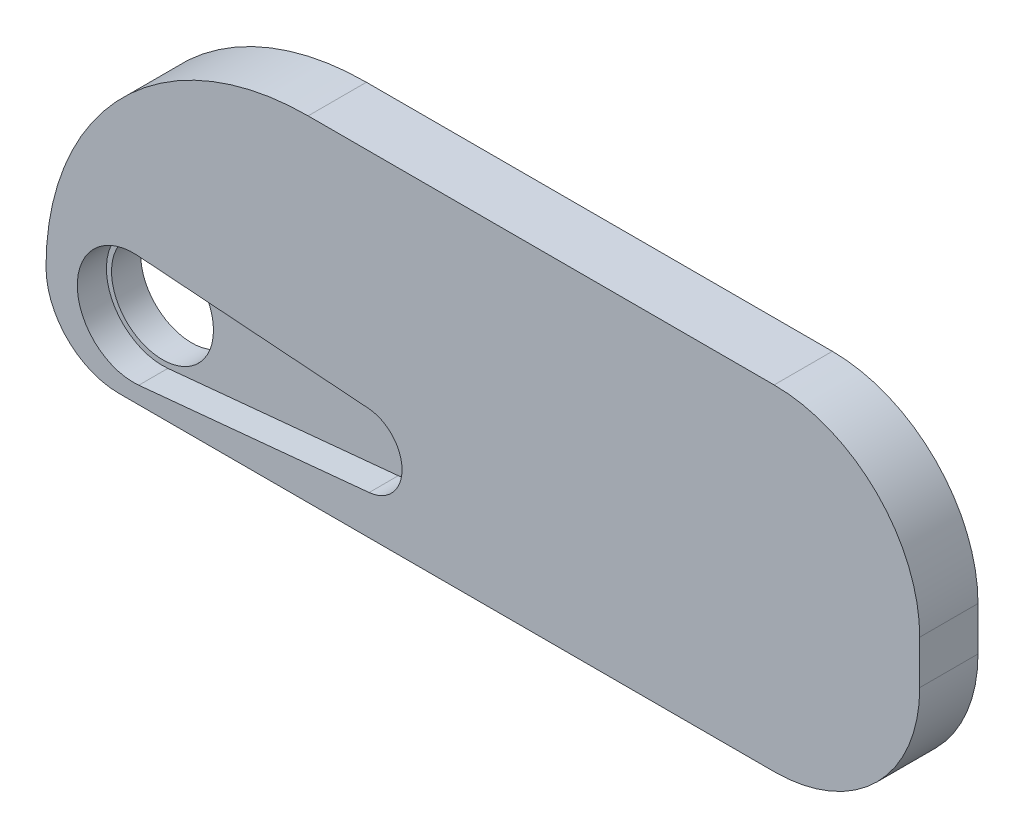
ISO-10303-21;
HEADER;
FILE_DESCRIPTION(('STEP AP214'),'2;1');
FILE_NAME('part.step','',(''),(''),'','','');
FILE_SCHEMA(('AUTOMOTIVE_DESIGN { 1 0 10303 214 1 1 1 1 }'));
ENDSEC;
DATA;
#1=APPLICATION_CONTEXT('core data for automotive mechanical design processes');
#2=APPLICATION_PROTOCOL_DEFINITION('international standard','automotive_design',2000,#1);
#3=PRODUCT_CONTEXT('',#1,'mechanical');
#4=PRODUCT('Part','Part','',(#3));
#5=PRODUCT_RELATED_PRODUCT_CATEGORY('part','',(#4));
#6=PRODUCT_DEFINITION_FORMATION('','',#4);
#7=PRODUCT_DEFINITION_CONTEXT('part definition',#1,'design');
#8=PRODUCT_DEFINITION('design','',#6,#7);
#9=PRODUCT_DEFINITION_SHAPE('','',#8);
#10=(LENGTH_UNIT() NAMED_UNIT(*) SI_UNIT(.MILLI.,.METRE.));
#11=(NAMED_UNIT(*) PLANE_ANGLE_UNIT() SI_UNIT($,.RADIAN.));
#12=(NAMED_UNIT(*) SI_UNIT($,.STERADIAN.) SOLID_ANGLE_UNIT());
#13=UNCERTAINTY_MEASURE_WITH_UNIT(LENGTH_MEASURE(1.E-05),#10,'distance_accuracy_value','');
#14=(GEOMETRIC_REPRESENTATION_CONTEXT(3) GLOBAL_UNCERTAINTY_ASSIGNED_CONTEXT((#13)) GLOBAL_UNIT_ASSIGNED_CONTEXT((#10,
#11,#12)) REPRESENTATION_CONTEXT('',''));
#15=CARTESIAN_POINT('',(0.,0.,0.));
#16=DIRECTION('',(0.,0.,1.));
#17=DIRECTION('',(1.,0.,0.));
#18=AXIS2_PLACEMENT_3D('',#15,#16,#17);
#19=CARTESIAN_POINT('',(0.,18.,4.));
#20=DIRECTION('',(0.,-1.,0.));
#21=DIRECTION('',(0.,0.,-1.));
#22=AXIS2_PLACEMENT_3D('',#19,#20,#21);
#23=PLANE('',#22);
#24=DIRECTION('',(0.,0.,1.));
#25=VECTOR('',#24,1.);
#26=CARTESIAN_POINT('',(18.,18.,0.));
#27=LINE('',#26,#25);
#28=CARTESIAN_POINT('',(18.,18.,0.));
#29=VERTEX_POINT('',#28);
#30=CARTESIAN_POINT('',(18.,18.,4.));
#31=VERTEX_POINT('',#30);
#32=EDGE_CURVE('E119',#29,#31,#27,.T.);
#33=ORIENTED_EDGE('',*,*,#32,.T.);
#34=DIRECTION('',(-1.,0.,0.));
#35=VECTOR('',#34,1.);
#36=CARTESIAN_POINT('',(0.,18.,4.));
#37=LINE('',#36,#35);
#38=CARTESIAN_POINT('',(50.,18.,4.));
#39=VERTEX_POINT('',#38);
#40=EDGE_CURVE('E151',#39,#31,#37,.T.);
#41=ORIENTED_EDGE('',*,*,#40,.F.);
#42=DIRECTION('',(0.,0.,-1.));
#43=VECTOR('',#42,1.);
#44=CARTESIAN_POINT('',(50.,18.,4.));
#45=LINE('',#44,#43);
#46=CARTESIAN_POINT('',(50.,18.,0.));
#47=VERTEX_POINT('',#46);
#48=EDGE_CURVE('E138',#39,#47,#45,.T.);
#49=ORIENTED_EDGE('',*,*,#48,.T.);
#50=DIRECTION('',(-1.,0.,0.));
#51=VECTOR('',#50,1.);
#52=CARTESIAN_POINT('',(0.,18.,0.));
#53=LINE('',#52,#51);
#54=EDGE_CURVE('E131',#47,#29,#53,.T.);
#55=ORIENTED_EDGE('',*,*,#54,.T.);
#56=EDGE_LOOP('',(#33,#41,#49,#55));
#57=FACE_BOUND('',#56,.T.);
#58=ADVANCED_FACE('F39',(#57),#23,.F.);
#59=CARTESIAN_POINT('',(6.,0.,0.));
#60=DIRECTION('',(0.,0.,1.));
#61=DIRECTION('',(1.,0.,0.));
#62=AXIS2_PLACEMENT_3D('',#59,#60,#61);
#63=CYLINDRICAL_SURFACE('',#62,3.5);
#64=CARTESIAN_POINT('',(6.,0.,0.));
#65=DIRECTION('',(0.,0.,1.));
#66=DIRECTION('',(1.,0.,0.));
#67=AXIS2_PLACEMENT_3D('',#64,#65,#66);
#68=CIRCLE('',#67,3.5);
#69=CARTESIAN_POINT('',(9.5,0.,0.));
#70=VERTEX_POINT('',#69);
#71=EDGE_CURVE('E172',#70,#70,#68,.T.);
#72=ORIENTED_EDGE('',*,*,#71,.F.);
#73=EDGE_LOOP('',(#72));
#74=FACE_BOUND('',#73,.T.);
#75=CARTESIAN_POINT('',(6.,0.,2.));
#76=DIRECTION('',(0.,0.,1.));
#77=DIRECTION('',(1.,0.,0.));
#78=AXIS2_PLACEMENT_3D('',#75,#76,#77);
#79=CIRCLE('',#78,3.5);
#80=CARTESIAN_POINT('',(9.5,0.,2.));
#81=VERTEX_POINT('',#80);
#82=EDGE_CURVE('E169',#81,#81,#79,.F.);
#83=ORIENTED_EDGE('',*,*,#82,.F.);
#84=EDGE_LOOP('',(#83));
#85=FACE_BOUND('',#84,.T.);
#86=ADVANCED_FACE('F253',(#74,#85),#63,.F.);
#87=CARTESIAN_POINT('',(0.,-5.,4.));
#88=DIRECTION('',(0.,1.,0.));
#89=DIRECTION('',(-1.,0.,0.));
#90=AXIS2_PLACEMENT_3D('',#87,#88,#89);
#91=PLANE('',#90);
#92=DIRECTION('',(1.,0.,0.));
#93=VECTOR('',#92,1.);
#94=CARTESIAN_POINT('',(0.,-5.,4.));
#95=LINE('',#94,#93);
#96=CARTESIAN_POINT('',(5.,-5.,4.));
#97=VERTEX_POINT('',#96);
#98=CARTESIAN_POINT('',(50.,-5.,4.));
#99=VERTEX_POINT('',#98);
#100=EDGE_CURVE('E139',#97,#99,#95,.T.);
#101=ORIENTED_EDGE('',*,*,#100,.F.);
#102=DIRECTION('',(0.,0.,-1.));
#103=VECTOR('',#102,1.);
#104=CARTESIAN_POINT('',(5.,-5.,4.));
#105=LINE('',#104,#103);
#106=CARTESIAN_POINT('',(5.,-5.,0.));
#107=VERTEX_POINT('',#106);
#108=EDGE_CURVE('E168',#97,#107,#105,.T.);
#109=ORIENTED_EDGE('',*,*,#108,.T.);
#110=DIRECTION('',(1.,0.,0.));
#111=VECTOR('',#110,1.);
#112=CARTESIAN_POINT('',(0.,-5.,0.));
#113=LINE('',#112,#111);
#114=CARTESIAN_POINT('',(50.,-5.,0.));
#115=VERTEX_POINT('',#114);
#116=EDGE_CURVE('E145',#107,#115,#113,.T.);
#117=ORIENTED_EDGE('',*,*,#116,.T.);
#118=DIRECTION('',(0.,0.,-1.));
#119=VECTOR('',#118,1.);
#120=CARTESIAN_POINT('',(50.,-5.,4.));
#121=LINE('',#120,#119);
#122=EDGE_CURVE('E165',#115,#99,#121,.F.);
#123=ORIENTED_EDGE('',*,*,#122,.T.);
#124=EDGE_LOOP('',(#101,#109,#117,#123));
#125=FACE_BOUND('',#124,.T.);
#126=ADVANCED_FACE('F182',(#125),#91,.F.);
#127=CARTESIAN_POINT('',(60.,18.,4.));
#128=DIRECTION('',(-1.,0.,0.));
#129=DIRECTION('',(0.,0.,1.));
#130=AXIS2_PLACEMENT_3D('',#127,#128,#129);
#131=PLANE('',#130);
#132=DIRECTION('',(0.,1.,0.));
#133=VECTOR('',#132,1.);
#134=CARTESIAN_POINT('',(60.,18.,0.));
#135=LINE('',#134,#133);
#136=CARTESIAN_POINT('',(60.,5.,0.));
#137=VERTEX_POINT('',#136);
#138=CARTESIAN_POINT('',(60.,8.,0.));
#139=VERTEX_POINT('',#138);
#140=EDGE_CURVE('E140',#137,#139,#135,.T.);
#141=ORIENTED_EDGE('',*,*,#140,.T.);
#142=DIRECTION('',(0.,0.,-1.));
#143=VECTOR('',#142,1.);
#144=CARTESIAN_POINT('',(60.,8.,4.));
#145=LINE('',#144,#143);
#146=CARTESIAN_POINT('',(60.,8.,4.));
#147=VERTEX_POINT('',#146);
#148=EDGE_CURVE('E159',#139,#147,#145,.F.);
#149=ORIENTED_EDGE('',*,*,#148,.T.);
#150=DIRECTION('',(0.,1.,0.));
#151=VECTOR('',#150,1.);
#152=CARTESIAN_POINT('',(60.,18.,4.));
#153=LINE('',#152,#151);
#154=CARTESIAN_POINT('',(60.,5.,4.));
#155=VERTEX_POINT('',#154);
#156=EDGE_CURVE('E142',#155,#147,#153,.T.);
#157=ORIENTED_EDGE('',*,*,#156,.F.);
#158=DIRECTION('',(0.,0.,-1.));
#159=VECTOR('',#158,1.);
#160=CARTESIAN_POINT('',(60.,5.,4.));
#161=LINE('',#160,#159);
#162=EDGE_CURVE('E156',#155,#137,#161,.T.);
#163=ORIENTED_EDGE('',*,*,#162,.T.);
#164=EDGE_LOOP('',(#141,#149,#157,#163));
#165=FACE_BOUND('',#164,.T.);
#166=ADVANCED_FACE('F240',(#165),#131,.F.);
#167=CARTESIAN_POINT('',(0.,0.,4.));
#168=DIRECTION('',(0.,0.,1.));
#169=DIRECTION('',(1.,0.,0.));
#170=AXIS2_PLACEMENT_3D('',#167,#168,#169);
#171=PLANE('',#170);
#172=CARTESIAN_POINT('',(18.,0.,4.));
#173=DIRECTION('',(0.,0.,-1.));
#174=DIRECTION('',(1.,0.,0.));
#175=AXIS2_PLACEMENT_3D('',#172,#173,#174);
#176=CIRCLE('',#175,18.);
#177=CARTESIAN_POINT('',(0.,0.,4.));
#178=VERTEX_POINT('',#177);
#179=EDGE_CURVE('E121',#178,#31,#176,.T.);
#180=ORIENTED_EDGE('',*,*,#179,.F.);
#181=CARTESIAN_POINT('',(5.,0.,4.));
#182=DIRECTION('',(0.,0.,1.));
#183=DIRECTION('',(1.,0.,0.));
#184=AXIS2_PLACEMENT_3D('',#181,#182,#183);
#185=CIRCLE('',#184,5.);
#186=EDGE_CURVE('E11',#178,#97,#185,.T.);
#187=ORIENTED_EDGE('',*,*,#186,.T.);
#188=ORIENTED_EDGE('',*,*,#100,.T.);
#189=CARTESIAN_POINT('',(50.,5.,4.));
#190=DIRECTION('',(0.,0.,1.));
#191=DIRECTION('',(1.,0.,0.));
#192=AXIS2_PLACEMENT_3D('',#189,#190,#191);
#193=CIRCLE('',#192,10.);
#194=EDGE_CURVE('E161',#99,#155,#193,.T.);
#195=ORIENTED_EDGE('',*,*,#194,.T.);
#196=ORIENTED_EDGE('',*,*,#156,.T.);
#197=CARTESIAN_POINT('',(50.,8.,4.));
#198=DIRECTION('',(0.,0.,1.));
#199=DIRECTION('',(1.,0.,0.));
#200=AXIS2_PLACEMENT_3D('',#197,#198,#199);
#201=CIRCLE('',#200,10.);
#202=EDGE_CURVE('E163',#147,#39,#201,.T.);
#203=ORIENTED_EDGE('',*,*,#202,.T.);
#204=ORIENTED_EDGE('',*,*,#40,.T.);
#205=EDGE_LOOP('',(#180,#187,#188,#195,#196,#203,#204));
#206=FACE_BOUND('',#205,.T.);
#207=CARTESIAN_POINT('',(6.00000000000035,-6.16694195709755E-13,4.));
#208=DIRECTION('',(0.,0.,1.));
#209=DIRECTION('',(1.,0.,0.));
#210=AXIS2_PLACEMENT_3D('',#207,#208,#209);
#211=CIRCLE('',#210,3.85000000000071);
#212=CARTESIAN_POINT('',(6.28156000805812,3.83969060757026,4.));
#213=VERTEX_POINT('',#212);
#214=CARTESIAN_POINT('',(6.37012071171951,-3.83216787977337,4.));
#215=VERTEX_POINT('',#214);
#216=EDGE_CURVE('E126',#213,#215,#211,.T.);
#217=ORIENTED_EDGE('',*,*,#216,.F.);
#218=DIRECTION('',(-0.99732223573251,0.0731324696253838,0.));
#219=VECTOR('',#218,1.);
#220=CARTESIAN_POINT('',(6.28156000805812,3.83969060757026,4.));
#221=LINE('',#220,#219);
#222=CARTESIAN_POINT('',(22.1317685779058,2.67741340642172,4.));
#223=VERTEX_POINT('',#222);
#224=EDGE_CURVE('E200',#223,#213,#221,.T.);
#225=ORIENTED_EDGE('',*,*,#224,.F.);
#226=CARTESIAN_POINT('',(21.9489374038425,0.184107817090359,4.));
#227=DIRECTION('',(0.,0.,1.));
#228=DIRECTION('',(-1.,0.,0.));
#229=AXIS2_PLACEMENT_3D('',#226,#227,#228);
#230=CIRCLE('',#229,2.50000000000009);
#231=CARTESIAN_POINT('',(22.1892755283354,-2.30431288406041,4.));
#232=VERTEX_POINT('',#231);
#233=EDGE_CURVE('E204',#232,#223,#230,.T.);
#234=ORIENTED_EDGE('',*,*,#233,.F.);
#235=DIRECTION('',(0.995368280460271,0.0961352497971664,0.));
#236=VECTOR('',#235,1.);
#237=CARTESIAN_POINT('',(22.1892755283354,-2.30431288406043,4.));
#238=LINE('',#237,#236);
#239=EDGE_CURVE('E207',#215,#232,#238,.T.);
#240=ORIENTED_EDGE('',*,*,#239,.F.);
#241=EDGE_LOOP('',(#217,#225,#234,#240));
#242=FACE_BOUND('',#241,.T.);
#243=ADVANCED_FACE('F177',(#206,#242),#171,.T.);
#244=CARTESIAN_POINT('',(0.,0.,0.));
#245=DIRECTION('',(0.,0.,1.));
#246=DIRECTION('',(1.,0.,0.));
#247=AXIS2_PLACEMENT_3D('',#244,#245,#246);
#248=PLANE('',#247);
#249=ORIENTED_EDGE('',*,*,#71,.T.);
#250=EDGE_LOOP('',(#249));
#251=FACE_BOUND('',#250,.T.);
#252=CARTESIAN_POINT('',(5.,0.,0.));
#253=DIRECTION('',(0.,0.,1.));
#254=DIRECTION('',(1.,0.,0.));
#255=AXIS2_PLACEMENT_3D('',#252,#253,#254);
#256=CIRCLE('',#255,5.);
#257=CARTESIAN_POINT('',(0.,0.,0.));
#258=VERTEX_POINT('',#257);
#259=EDGE_CURVE('E133',#107,#258,#256,.F.);
#260=ORIENTED_EDGE('',*,*,#259,.T.);
#261=CARTESIAN_POINT('',(18.,0.,0.));
#262=DIRECTION('',(0.,0.,-1.));
#263=DIRECTION('',(1.,0.,0.));
#264=AXIS2_PLACEMENT_3D('',#261,#262,#263);
#265=CIRCLE('',#264,18.);
#266=EDGE_CURVE('E54',#258,#29,#265,.T.);
#267=ORIENTED_EDGE('',*,*,#266,.T.);
#268=ORIENTED_EDGE('',*,*,#54,.F.);
#269=CARTESIAN_POINT('',(50.,8.,0.));
#270=DIRECTION('',(0.,0.,1.));
#271=DIRECTION('',(1.,0.,0.));
#272=AXIS2_PLACEMENT_3D('',#269,#270,#271);
#273=CIRCLE('',#272,10.);
#274=EDGE_CURVE('E154',#47,#139,#273,.F.);
#275=ORIENTED_EDGE('',*,*,#274,.T.);
#276=ORIENTED_EDGE('',*,*,#140,.F.);
#277=CARTESIAN_POINT('',(50.,5.,0.));
#278=DIRECTION('',(0.,0.,1.));
#279=DIRECTION('',(1.,0.,0.));
#280=AXIS2_PLACEMENT_3D('',#277,#278,#279);
#281=CIRCLE('',#280,10.);
#282=EDGE_CURVE('E150',#137,#115,#281,.F.);
#283=ORIENTED_EDGE('',*,*,#282,.T.);
#284=ORIENTED_EDGE('',*,*,#116,.F.);
#285=EDGE_LOOP('',(#260,#267,#268,#275,#276,#283,#284));
#286=FACE_BOUND('',#285,.T.);
#287=ADVANCED_FACE('F130',(#251,#286),#248,.F.);
#288=CARTESIAN_POINT('',(50.,8.,4.));
#289=DIRECTION('',(0.,0.,-1.));
#290=DIRECTION('',(-1.,0.,0.));
#291=AXIS2_PLACEMENT_3D('',#288,#289,#290);
#292=CYLINDRICAL_SURFACE('',#291,10.);
#293=ORIENTED_EDGE('',*,*,#202,.F.);
#294=ORIENTED_EDGE('',*,*,#148,.F.);
#295=ORIENTED_EDGE('',*,*,#274,.F.);
#296=ORIENTED_EDGE('',*,*,#48,.F.);
#297=EDGE_LOOP('',(#293,#294,#295,#296));
#298=FACE_BOUND('',#297,.T.);
#299=ADVANCED_FACE('F246',(#298),#292,.T.);
#300=CARTESIAN_POINT('',(50.,5.,4.));
#301=DIRECTION('',(0.,0.,-1.));
#302=DIRECTION('',(-1.,0.,0.));
#303=AXIS2_PLACEMENT_3D('',#300,#301,#302);
#304=CYLINDRICAL_SURFACE('',#303,10.);
#305=ORIENTED_EDGE('',*,*,#194,.F.);
#306=ORIENTED_EDGE('',*,*,#122,.F.);
#307=ORIENTED_EDGE('',*,*,#282,.F.);
#308=ORIENTED_EDGE('',*,*,#162,.F.);
#309=EDGE_LOOP('',(#305,#306,#307,#308));
#310=FACE_BOUND('',#309,.T.);
#311=ADVANCED_FACE('F263',(#310),#304,.T.);
#312=CARTESIAN_POINT('',(6.00000000000035,-6.16694195709755E-13,2.));
#313=DIRECTION('',(0.,0.,1.));
#314=DIRECTION('',(1.,0.,0.));
#315=AXIS2_PLACEMENT_3D('',#312,#313,#314);
#316=PLANE('',#315);
#317=CARTESIAN_POINT('',(6.00000000000035,-6.16694195709755E-13,2.));
#318=DIRECTION('',(0.,0.,1.));
#319=DIRECTION('',(1.,0.,0.));
#320=AXIS2_PLACEMENT_3D('',#317,#318,#319);
#321=CIRCLE('',#320,3.85000000000071);
#322=CARTESIAN_POINT('',(6.28156000805812,3.83969060757026,2.));
#323=VERTEX_POINT('',#322);
#324=CARTESIAN_POINT('',(6.37012071171951,-3.83216787977337,2.));
#325=VERTEX_POINT('',#324);
#326=EDGE_CURVE('E203',#323,#325,#321,.T.);
#327=ORIENTED_EDGE('',*,*,#326,.T.);
#328=DIRECTION('',(0.995368280460271,0.0961352497971664,0.));
#329=VECTOR('',#328,1.);
#330=CARTESIAN_POINT('',(22.1892755283354,-2.30431288406043,2.));
#331=LINE('',#330,#329);
#332=CARTESIAN_POINT('',(22.1892755283354,-2.30431288406041,2.));
#333=VERTEX_POINT('',#332);
#334=EDGE_CURVE('E216',#325,#333,#331,.T.);
#335=ORIENTED_EDGE('',*,*,#334,.T.);
#336=CARTESIAN_POINT('',(21.9489374038425,0.184107817090359,2.));
#337=DIRECTION('',(0.,0.,1.));
#338=DIRECTION('',(-1.,0.,0.));
#339=AXIS2_PLACEMENT_3D('',#336,#337,#338);
#340=CIRCLE('',#339,2.50000000000009);
#341=CARTESIAN_POINT('',(22.1317685779058,2.67741340642172,2.));
#342=VERTEX_POINT('',#341);
#343=EDGE_CURVE('E213',#333,#342,#340,.T.);
#344=ORIENTED_EDGE('',*,*,#343,.T.);
#345=DIRECTION('',(-0.99732223573251,0.0731324696253838,0.));
#346=VECTOR('',#345,1.);
#347=CARTESIAN_POINT('',(6.28156000805812,3.83969060757026,2.));
#348=LINE('',#347,#346);
#349=EDGE_CURVE('E195',#342,#323,#348,.T.);
#350=ORIENTED_EDGE('',*,*,#349,.T.);
#351=EDGE_LOOP('',(#327,#335,#344,#350));
#352=FACE_BOUND('',#351,.T.);
#353=ORIENTED_EDGE('',*,*,#82,.T.);
#354=EDGE_LOOP('',(#353));
#355=FACE_BOUND('',#354,.T.);
#356=ADVANCED_FACE('F222',(#352,#355),#316,.T.);
#357=CARTESIAN_POINT('',(6.00000000000035,-6.16694195709755E-13,2.));
#358=DIRECTION('',(0.,0.,1.));
#359=DIRECTION('',(1.,0.,0.));
#360=AXIS2_PLACEMENT_3D('',#357,#358,#359);
#361=CYLINDRICAL_SURFACE('',#360,3.85000000000071);
#362=ORIENTED_EDGE('',*,*,#216,.T.);
#363=DIRECTION('',(0.,0.,1.));
#364=VECTOR('',#363,1.);
#365=CARTESIAN_POINT('',(6.37012071171951,-3.83216787977337,2.));
#366=LINE('',#365,#364);
#367=EDGE_CURVE('E191',#325,#215,#366,.T.);
#368=ORIENTED_EDGE('',*,*,#367,.F.);
#369=ORIENTED_EDGE('',*,*,#326,.F.);
#370=DIRECTION('',(0.,0.,1.));
#371=VECTOR('',#370,1.);
#372=CARTESIAN_POINT('',(6.28156000805812,3.83969060757026,2.));
#373=LINE('',#372,#371);
#374=EDGE_CURVE('E173',#323,#213,#373,.T.);
#375=ORIENTED_EDGE('',*,*,#374,.T.);
#376=EDGE_LOOP('',(#362,#368,#369,#375));
#377=FACE_BOUND('',#376,.T.);
#378=ADVANCED_FACE('F227',(#377),#361,.F.);
#379=CARTESIAN_POINT('',(6.28156000805812,3.83969060757026,2.));
#380=DIRECTION('',(0.0731324696253838,0.99732223573251,0.));
#381=DIRECTION('',(-0.99732223573251,0.0731324696253839,0.));
#382=AXIS2_PLACEMENT_3D('',#379,#380,#381);
#383=PLANE('',#382);
#384=ORIENTED_EDGE('',*,*,#224,.T.);
#385=ORIENTED_EDGE('',*,*,#374,.F.);
#386=ORIENTED_EDGE('',*,*,#349,.F.);
#387=DIRECTION('',(0.,0.,1.));
#388=VECTOR('',#387,1.);
#389=CARTESIAN_POINT('',(22.1317685779058,2.67741340642172,2.));
#390=LINE('',#389,#388);
#391=EDGE_CURVE('E197',#342,#223,#390,.T.);
#392=ORIENTED_EDGE('',*,*,#391,.T.);
#393=EDGE_LOOP('',(#384,#385,#386,#392));
#394=FACE_BOUND('',#393,.T.);
#395=ADVANCED_FACE('F237',(#394),#383,.F.);
#396=CARTESIAN_POINT('',(21.9489374038425,0.184107817090359,2.));
#397=DIRECTION('',(0.,0.,1.));
#398=DIRECTION('',(1.,0.,0.));
#399=AXIS2_PLACEMENT_3D('',#396,#397,#398);
#400=CYLINDRICAL_SURFACE('',#399,2.50000000000009);
#401=ORIENTED_EDGE('',*,*,#233,.T.);
#402=ORIENTED_EDGE('',*,*,#391,.F.);
#403=ORIENTED_EDGE('',*,*,#343,.F.);
#404=DIRECTION('',(0.,0.,1.));
#405=VECTOR('',#404,1.);
#406=CARTESIAN_POINT('',(22.1892755283354,-2.30431288406041,2.));
#407=LINE('',#406,#405);
#408=EDGE_CURVE('E194',#333,#232,#407,.T.);
#409=ORIENTED_EDGE('',*,*,#408,.T.);
#410=EDGE_LOOP('',(#401,#402,#403,#409));
#411=FACE_BOUND('',#410,.T.);
#412=ADVANCED_FACE('F235',(#411),#400,.F.);
#413=CARTESIAN_POINT('',(22.1892755283354,-2.30431288406043,2.));
#414=DIRECTION('',(0.0961352497971664,-0.995368280460271,0.));
#415=DIRECTION('',(0.995368280460271,0.0961352497971664,0.));
#416=AXIS2_PLACEMENT_3D('',#413,#414,#415);
#417=PLANE('',#416);
#418=ORIENTED_EDGE('',*,*,#239,.T.);
#419=ORIENTED_EDGE('',*,*,#408,.F.);
#420=ORIENTED_EDGE('',*,*,#334,.F.);
#421=ORIENTED_EDGE('',*,*,#367,.T.);
#422=EDGE_LOOP('',(#418,#419,#420,#421));
#423=FACE_BOUND('',#422,.T.);
#424=ADVANCED_FACE('F231',(#423),#417,.F.);
#425=CARTESIAN_POINT('',(5.,0.,4.));
#426=DIRECTION('',(0.,0.,-1.));
#427=DIRECTION('',(-1.,0.,0.));
#428=AXIS2_PLACEMENT_3D('',#425,#426,#427);
#429=CYLINDRICAL_SURFACE('',#428,5.);
#430=ORIENTED_EDGE('',*,*,#186,.F.);
#431=DIRECTION('',(0.,0.,-1.));
#432=VECTOR('',#431,1.);
#433=CARTESIAN_POINT('',(0.,0.,4.));
#434=LINE('',#433,#432);
#435=EDGE_CURVE('E47',#258,#178,#434,.F.);
#436=ORIENTED_EDGE('',*,*,#435,.F.);
#437=ORIENTED_EDGE('',*,*,#259,.F.);
#438=ORIENTED_EDGE('',*,*,#108,.F.);
#439=EDGE_LOOP('',(#430,#436,#437,#438));
#440=FACE_BOUND('',#439,.T.);
#441=ADVANCED_FACE('F41',(#440),#429,.T.);
#442=CARTESIAN_POINT('',(18.,0.,0.));
#443=DIRECTION('',(0.,0.,1.));
#444=DIRECTION('',(1.,0.,0.));
#445=AXIS2_PLACEMENT_3D('',#442,#443,#444);
#446=CYLINDRICAL_SURFACE('',#445,18.);
#447=ORIENTED_EDGE('',*,*,#179,.T.);
#448=ORIENTED_EDGE('',*,*,#32,.F.);
#449=ORIENTED_EDGE('',*,*,#266,.F.);
#450=ORIENTED_EDGE('',*,*,#435,.T.);
#451=EDGE_LOOP('',(#447,#448,#449,#450));
#452=FACE_BOUND('',#451,.T.);
#453=ADVANCED_FACE('F120',(#452),#446,.T.);
#454=CLOSED_SHELL('',(#58,#86,#126,#166,#243,#287,#299,#311,#356,#378,#395,#412,#424,#441,#453));
#455=MANIFOLD_SOLID_BREP('B2',#454);
#456=ADVANCED_BREP_SHAPE_REPRESENTATION('',(#18,#455),#14);
#457=SHAPE_DEFINITION_REPRESENTATION(#9,#456);
ENDSEC;
END-ISO-10303-21;
